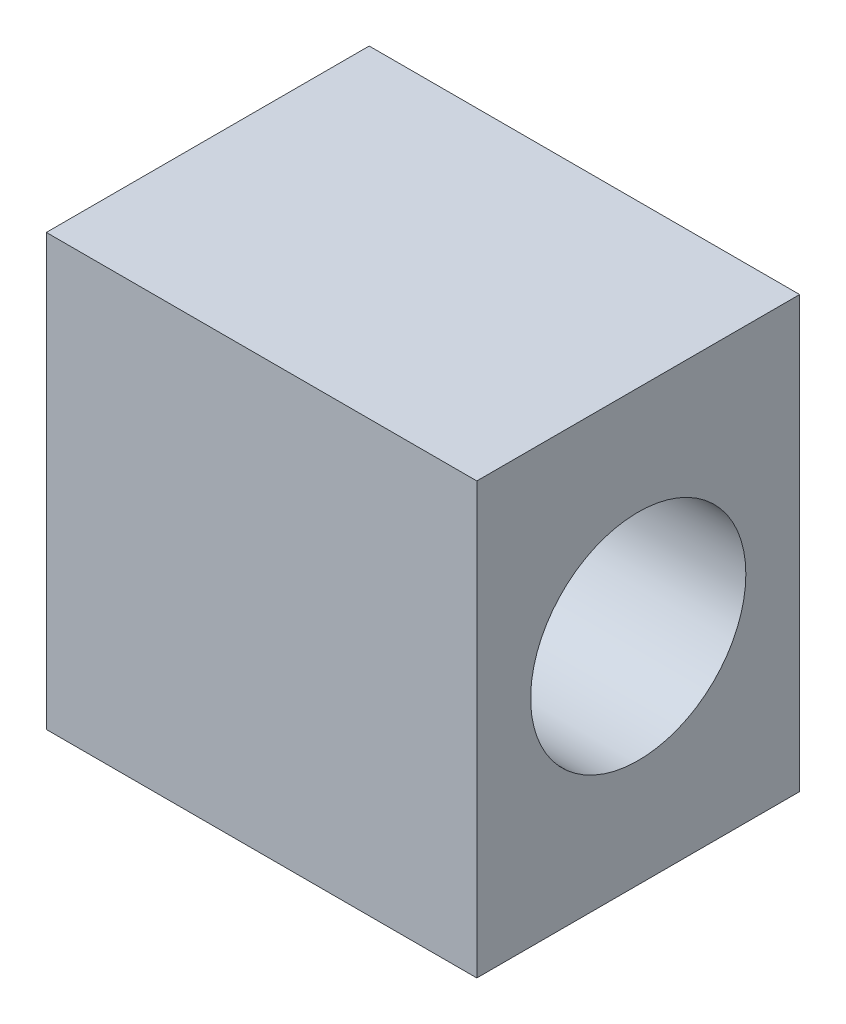
ISO-10303-21;
HEADER;
FILE_DESCRIPTION(('STEP AP214'),'2;1');
FILE_NAME('part.step','',(''),(''),'','','');
FILE_SCHEMA(('AUTOMOTIVE_DESIGN { 1 0 10303 214 1 1 1 1 }'));
ENDSEC;
DATA;
#1=APPLICATION_CONTEXT('core data for automotive mechanical design processes');
#2=APPLICATION_PROTOCOL_DEFINITION('international standard','automotive_design',2000,#1);
#3=PRODUCT_CONTEXT('',#1,'mechanical');
#4=PRODUCT('Part','Part','',(#3));
#5=PRODUCT_RELATED_PRODUCT_CATEGORY('part','',(#4));
#6=PRODUCT_DEFINITION_FORMATION('','',#4);
#7=PRODUCT_DEFINITION_CONTEXT('part definition',#1,'design');
#8=PRODUCT_DEFINITION('design','',#6,#7);
#9=PRODUCT_DEFINITION_SHAPE('','',#8);
#10=(LENGTH_UNIT() NAMED_UNIT(*) SI_UNIT(.MILLI.,.METRE.));
#11=(NAMED_UNIT(*) PLANE_ANGLE_UNIT() SI_UNIT($,.RADIAN.));
#12=(NAMED_UNIT(*) SI_UNIT($,.STERADIAN.) SOLID_ANGLE_UNIT());
#13=UNCERTAINTY_MEASURE_WITH_UNIT(LENGTH_MEASURE(1.E-05),#10,'distance_accuracy_value','');
#14=(GEOMETRIC_REPRESENTATION_CONTEXT(3) GLOBAL_UNCERTAINTY_ASSIGNED_CONTEXT((#13)) GLOBAL_UNIT_ASSIGNED_CONTEXT((#10,
#11,#12)) REPRESENTATION_CONTEXT('',''));
#15=CARTESIAN_POINT('',(0.,0.,0.));
#16=DIRECTION('',(0.,0.,1.));
#17=DIRECTION('',(1.,0.,0.));
#18=AXIS2_PLACEMENT_3D('',#15,#16,#17);
#19=CARTESIAN_POINT('',(10.,20.,7.5));
#20=DIRECTION('',(-1.,0.,0.));
#21=DIRECTION('',(0.,0.,1.));
#22=AXIS2_PLACEMENT_3D('',#19,#20,#21);
#23=PLANE('',#22);
#24=CARTESIAN_POINT('',(10.,10.,0.));
#25=DIRECTION('',(1.,0.,0.));
#26=DIRECTION('',(0.,0.,-1.));
#27=AXIS2_PLACEMENT_3D('',#24,#25,#26);
#28=CIRCLE('',#27,5.);
#29=CARTESIAN_POINT('',(10.,10.,-5.));
#30=VERTEX_POINT('',#29);
#31=EDGE_CURVE('E125',#30,#30,#28,.T.);
#32=ORIENTED_EDGE('',*,*,#31,.F.);
#33=EDGE_LOOP('',(#32));
#34=FACE_BOUND('',#33,.T.);
#35=DIRECTION('',(0.,0.,-1.));
#36=VECTOR('',#35,1.);
#37=CARTESIAN_POINT('',(10.,0.,7.5));
#38=LINE('',#37,#36);
#39=CARTESIAN_POINT('',(10.,0.,7.5));
#40=VERTEX_POINT('',#39);
#41=CARTESIAN_POINT('',(10.,0.,-7.5));
#42=VERTEX_POINT('',#41);
#43=EDGE_CURVE('E104',#40,#42,#38,.T.);
#44=ORIENTED_EDGE('',*,*,#43,.T.);
#45=DIRECTION('',(0.,-1.,0.));
#46=VECTOR('',#45,1.);
#47=CARTESIAN_POINT('',(10.,20.,-7.5));
#48=LINE('',#47,#46);
#49=CARTESIAN_POINT('',(10.,20.,-7.5));
#50=VERTEX_POINT('',#49);
#51=EDGE_CURVE('E11',#50,#42,#48,.T.);
#52=ORIENTED_EDGE('',*,*,#51,.F.);
#53=DIRECTION('',(0.,0.,-1.));
#54=VECTOR('',#53,1.);
#55=CARTESIAN_POINT('',(10.,20.,7.5));
#56=LINE('',#55,#54);
#57=CARTESIAN_POINT('',(10.,20.,7.5));
#58=VERTEX_POINT('',#57);
#59=EDGE_CURVE('E88',#58,#50,#56,.T.);
#60=ORIENTED_EDGE('',*,*,#59,.F.);
#61=DIRECTION('',(0.,-1.,0.));
#62=VECTOR('',#61,1.);
#63=CARTESIAN_POINT('',(10.,20.,7.5));
#64=LINE('',#63,#62);
#65=EDGE_CURVE('E100',#58,#40,#64,.T.);
#66=ORIENTED_EDGE('',*,*,#65,.T.);
#67=EDGE_LOOP('',(#44,#52,#60,#66));
#68=FACE_BOUND('',#67,.T.);
#69=ADVANCED_FACE('F36',(#34,#68),#23,.F.);
#70=CARTESIAN_POINT('',(-10.,20.,-7.5));
#71=DIRECTION('',(0.,0.,1.));
#72=DIRECTION('',(1.,0.,0.));
#73=AXIS2_PLACEMENT_3D('',#70,#71,#72);
#74=PLANE('',#73);
#75=DIRECTION('',(-1.,0.,0.));
#76=VECTOR('',#75,1.);
#77=CARTESIAN_POINT('',(-10.,0.,-7.5));
#78=LINE('',#77,#76);
#79=CARTESIAN_POINT('',(-10.,0.,-7.5));
#80=VERTEX_POINT('',#79);
#81=EDGE_CURVE('E93',#42,#80,#78,.T.);
#82=ORIENTED_EDGE('',*,*,#81,.T.);
#83=DIRECTION('',(0.,-1.,0.));
#84=VECTOR('',#83,1.);
#85=CARTESIAN_POINT('',(-10.,20.,-7.5));
#86=LINE('',#85,#84);
#87=CARTESIAN_POINT('',(-10.,20.,-7.5));
#88=VERTEX_POINT('',#87);
#89=EDGE_CURVE('E45',#88,#80,#86,.T.);
#90=ORIENTED_EDGE('',*,*,#89,.F.);
#91=DIRECTION('',(-1.,0.,0.));
#92=VECTOR('',#91,1.);
#93=CARTESIAN_POINT('',(-10.,20.,-7.5));
#94=LINE('',#93,#92);
#95=EDGE_CURVE('E83',#50,#88,#94,.T.);
#96=ORIENTED_EDGE('',*,*,#95,.F.);
#97=ORIENTED_EDGE('',*,*,#51,.T.);
#98=EDGE_LOOP('',(#82,#90,#96,#97));
#99=FACE_BOUND('',#98,.T.);
#100=ADVANCED_FACE('F92',(#99),#74,.F.);
#101=CARTESIAN_POINT('',(-10.,20.,-7.5));
#102=DIRECTION('',(1.,0.,0.));
#103=DIRECTION('',(0.,0.,-1.));
#104=AXIS2_PLACEMENT_3D('',#101,#102,#103);
#105=PLANE('',#104);
#106=DIRECTION('',(0.,0.,1.));
#107=VECTOR('',#106,1.);
#108=CARTESIAN_POINT('',(-10.,0.,-7.5));
#109=LINE('',#108,#107);
#110=CARTESIAN_POINT('',(-10.,0.,7.5));
#111=VERTEX_POINT('',#110);
#112=EDGE_CURVE('E70',#80,#111,#109,.T.);
#113=ORIENTED_EDGE('',*,*,#112,.T.);
#114=DIRECTION('',(0.,-1.,0.));
#115=VECTOR('',#114,1.);
#116=CARTESIAN_POINT('',(-10.,20.,7.5));
#117=LINE('',#116,#115);
#118=CARTESIAN_POINT('',(-10.,20.,7.5));
#119=VERTEX_POINT('',#118);
#120=EDGE_CURVE('E95',#119,#111,#117,.T.);
#121=ORIENTED_EDGE('',*,*,#120,.F.);
#122=DIRECTION('',(0.,0.,1.));
#123=VECTOR('',#122,1.);
#124=CARTESIAN_POINT('',(-10.,20.,-7.5));
#125=LINE('',#124,#123);
#126=EDGE_CURVE('E86',#88,#119,#125,.T.);
#127=ORIENTED_EDGE('',*,*,#126,.F.);
#128=ORIENTED_EDGE('',*,*,#89,.T.);
#129=EDGE_LOOP('',(#113,#121,#127,#128));
#130=FACE_BOUND('',#129,.T.);
#131=ADVANCED_FACE('F96',(#130),#105,.F.);
#132=CARTESIAN_POINT('',(-10.,20.,7.5));
#133=DIRECTION('',(0.,0.,-1.));
#134=DIRECTION('',(-1.,0.,0.));
#135=AXIS2_PLACEMENT_3D('',#132,#133,#134);
#136=PLANE('',#135);
#137=DIRECTION('',(1.,0.,0.));
#138=VECTOR('',#137,1.);
#139=CARTESIAN_POINT('',(-10.,0.,7.5));
#140=LINE('',#139,#138);
#141=EDGE_CURVE('E76',#111,#40,#140,.T.);
#142=ORIENTED_EDGE('',*,*,#141,.T.);
#143=ORIENTED_EDGE('',*,*,#65,.F.);
#144=DIRECTION('',(1.,0.,0.));
#145=VECTOR('',#144,1.);
#146=CARTESIAN_POINT('',(-10.,20.,7.5));
#147=LINE('',#146,#145);
#148=EDGE_CURVE('E53',#119,#58,#147,.T.);
#149=ORIENTED_EDGE('',*,*,#148,.F.);
#150=ORIENTED_EDGE('',*,*,#120,.T.);
#151=EDGE_LOOP('',(#142,#143,#149,#150));
#152=FACE_BOUND('',#151,.T.);
#153=ADVANCED_FACE('F118',(#152),#136,.F.);
#154=CARTESIAN_POINT('',(0.,20.,0.));
#155=DIRECTION('',(0.,-1.,0.));
#156=DIRECTION('',(0.,0.,-1.));
#157=AXIS2_PLACEMENT_3D('',#154,#155,#156);
#158=PLANE('',#157);
#159=ORIENTED_EDGE('',*,*,#59,.T.);
#160=ORIENTED_EDGE('',*,*,#95,.T.);
#161=ORIENTED_EDGE('',*,*,#126,.T.);
#162=ORIENTED_EDGE('',*,*,#148,.T.);
#163=EDGE_LOOP('',(#159,#160,#161,#162));
#164=FACE_BOUND('',#163,.T.);
#165=ADVANCED_FACE('F84',(#164),#158,.F.);
#166=CARTESIAN_POINT('',(0.,0.,0.));
#167=DIRECTION('',(0.,-1.,0.));
#168=DIRECTION('',(0.,0.,-1.));
#169=AXIS2_PLACEMENT_3D('',#166,#167,#168);
#170=PLANE('',#169);
#171=CARTESIAN_POINT('',(0.,0.,0.));
#172=DIRECTION('',(0.,-1.,0.));
#173=DIRECTION('',(0.,0.,-1.));
#174=AXIS2_PLACEMENT_3D('',#171,#172,#173);
#175=CIRCLE('',#174,5.);
#176=CARTESIAN_POINT('',(0.,0.,-5.));
#177=VERTEX_POINT('',#176);
#178=EDGE_CURVE('E133',#177,#177,#175,.T.);
#179=ORIENTED_EDGE('',*,*,#178,.F.);
#180=EDGE_LOOP('',(#179));
#181=FACE_BOUND('',#180,.T.);
#182=ORIENTED_EDGE('',*,*,#43,.F.);
#183=ORIENTED_EDGE('',*,*,#141,.F.);
#184=ORIENTED_EDGE('',*,*,#112,.F.);
#185=ORIENTED_EDGE('',*,*,#81,.F.);
#186=EDGE_LOOP('',(#182,#183,#184,#185));
#187=FACE_BOUND('',#186,.T.);
#188=ADVANCED_FACE('F121',(#181,#187),#170,.T.);
#189=CARTESIAN_POINT('',(0.,10.,0.));
#190=DIRECTION('',(1.,0.,0.));
#191=DIRECTION('',(0.,0.,-1.));
#192=AXIS2_PLACEMENT_3D('',#189,#190,#191);
#193=CYLINDRICAL_SURFACE('',#192,5.);
#194=CARTESIAN_POINT('',(0.,10.,0.));
#195=DIRECTION('',(1.,0.,0.));
#196=DIRECTION('',(0.,0.,-1.));
#197=AXIS2_PLACEMENT_3D('',#194,#195,#196);
#198=CIRCLE('',#197,5.);
#199=CARTESIAN_POINT('',(0.,10.,-5.));
#200=VERTEX_POINT('',#199);
#201=EDGE_CURVE('E108',#200,#200,#198,.T.);
#202=ORIENTED_EDGE('',*,*,#201,.F.);
#203=EDGE_LOOP('',(#202));
#204=FACE_BOUND('',#203,.T.);
#205=ORIENTED_EDGE('',*,*,#31,.T.);
#206=EDGE_LOOP('',(#205));
#207=FACE_BOUND('',#206,.T.);
#208=ADVANCED_FACE('F151',(#204,#207),#193,.F.);
#209=CARTESIAN_POINT('',(0.,10.,0.));
#210=DIRECTION('',(1.,0.,0.));
#211=DIRECTION('',(0.,0.,-1.));
#212=AXIS2_PLACEMENT_3D('',#209,#210,#211);
#213=PLANE('',#212);
#214=ORIENTED_EDGE('',*,*,#201,.T.);
#215=EDGE_LOOP('',(#214));
#216=FACE_BOUND('',#215,.T.);
#217=ADVANCED_FACE('F146',(#216),#213,.T.);
#218=CARTESIAN_POINT('',(0.,4.,0.));
#219=DIRECTION('',(0.,-1.,0.));
#220=DIRECTION('',(0.,0.,-1.));
#221=AXIS2_PLACEMENT_3D('',#218,#219,#220);
#222=CYLINDRICAL_SURFACE('',#221,5.);
#223=CARTESIAN_POINT('',(0.,4.,0.));
#224=DIRECTION('',(0.,-1.,0.));
#225=DIRECTION('',(0.,0.,-1.));
#226=AXIS2_PLACEMENT_3D('',#223,#224,#225);
#227=CIRCLE('',#226,5.);
#228=CARTESIAN_POINT('',(0.,4.,-5.));
#229=VERTEX_POINT('',#228);
#230=EDGE_CURVE('E129',#229,#229,#227,.T.);
#231=ORIENTED_EDGE('',*,*,#230,.F.);
#232=EDGE_LOOP('',(#231));
#233=FACE_BOUND('',#232,.T.);
#234=ORIENTED_EDGE('',*,*,#178,.T.);
#235=EDGE_LOOP('',(#234));
#236=FACE_BOUND('',#235,.T.);
#237=ADVANCED_FACE('F143',(#233,#236),#222,.F.);
#238=CARTESIAN_POINT('',(0.,4.,0.));
#239=DIRECTION('',(0.,-1.,0.));
#240=DIRECTION('',(0.,0.,-1.));
#241=AXIS2_PLACEMENT_3D('',#238,#239,#240);
#242=PLANE('',#241);
#243=ORIENTED_EDGE('',*,*,#230,.T.);
#244=EDGE_LOOP('',(#243));
#245=FACE_BOUND('',#244,.T.);
#246=ADVANCED_FACE('F141',(#245),#242,.T.);
#247=CLOSED_SHELL('',(#69,#100,#131,#153,#165,#188,#208,#217,#237,#246));
#248=MANIFOLD_SOLID_BREP('B2',#247);
#249=ADVANCED_BREP_SHAPE_REPRESENTATION('',(#18,#248),#14);
#250=SHAPE_DEFINITION_REPRESENTATION(#9,#249);
ENDSEC;
END-ISO-10303-21;
